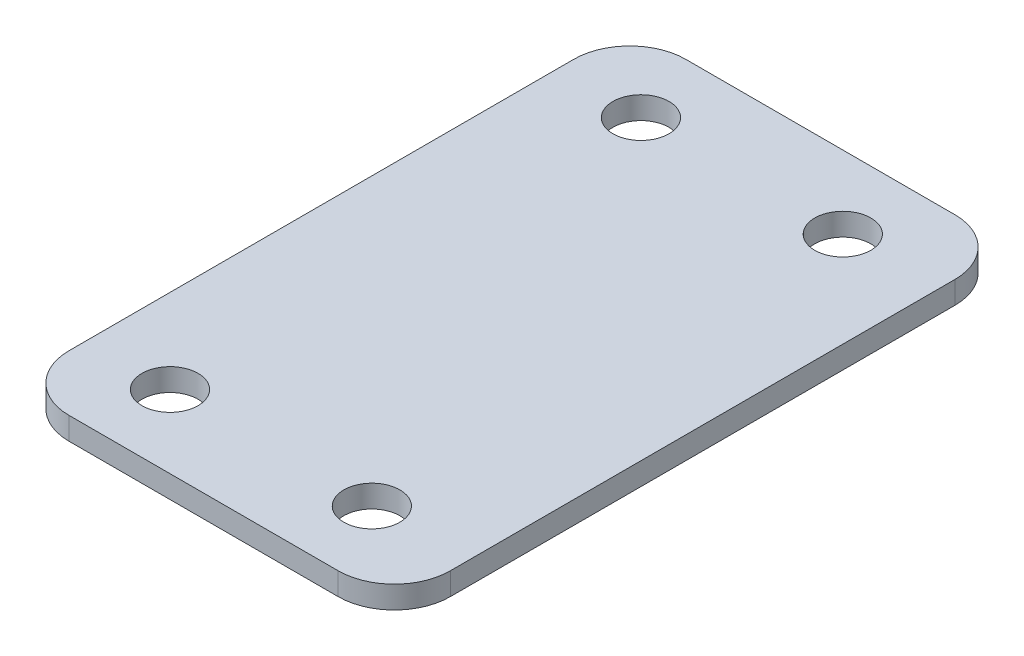
ISO-10303-21;
HEADER;
FILE_DESCRIPTION(('STEP AP214'),'2;1');
FILE_NAME('part.step','',(''),(''),'','','');
FILE_SCHEMA(('AUTOMOTIVE_DESIGN { 1 0 10303 214 1 1 1 1 }'));
ENDSEC;
DATA;
#1=APPLICATION_CONTEXT('core data for automotive mechanical design processes');
#2=APPLICATION_PROTOCOL_DEFINITION('international standard','automotive_design',2000,#1);
#3=PRODUCT_CONTEXT('',#1,'mechanical');
#4=PRODUCT('Part','Part','',(#3));
#5=PRODUCT_RELATED_PRODUCT_CATEGORY('part','',(#4));
#6=PRODUCT_DEFINITION_FORMATION('','',#4);
#7=PRODUCT_DEFINITION_CONTEXT('part definition',#1,'design');
#8=PRODUCT_DEFINITION('design','',#6,#7);
#9=PRODUCT_DEFINITION_SHAPE('','',#8);
#10=(LENGTH_UNIT() NAMED_UNIT(*) SI_UNIT(.MILLI.,.METRE.));
#11=(NAMED_UNIT(*) PLANE_ANGLE_UNIT() SI_UNIT($,.RADIAN.));
#12=(NAMED_UNIT(*) SI_UNIT($,.STERADIAN.) SOLID_ANGLE_UNIT());
#13=UNCERTAINTY_MEASURE_WITH_UNIT(LENGTH_MEASURE(1.E-05),#10,'distance_accuracy_value','');
#14=(GEOMETRIC_REPRESENTATION_CONTEXT(3) GLOBAL_UNCERTAINTY_ASSIGNED_CONTEXT((#13)) GLOBAL_UNIT_ASSIGNED_CONTEXT((#10,
#11,#12)) REPRESENTATION_CONTEXT('',''));
#15=CARTESIAN_POINT('',(0.,0.,0.));
#16=DIRECTION('',(0.,0.,1.));
#17=DIRECTION('',(1.,0.,0.));
#18=AXIS2_PLACEMENT_3D('',#15,#16,#17);
#19=CARTESIAN_POINT('',(-20.,2.,27.5));
#20=DIRECTION('',(1.,0.,0.));
#21=DIRECTION('',(0.,0.,-1.));
#22=AXIS2_PLACEMENT_3D('',#19,#20,#21);
#23=PLANE('',#22);
#24=DIRECTION('',(0.,0.,1.));
#25=VECTOR('',#24,1.);
#26=CARTESIAN_POINT('',(-20.,2.,27.5));
#27=LINE('',#26,#25);
#28=CARTESIAN_POINT('',(-20.,2.,-22.5));
#29=VERTEX_POINT('',#28);
#30=CARTESIAN_POINT('',(-20.,2.,22.5));
#31=VERTEX_POINT('',#30);
#32=EDGE_CURVE('E117',#29,#31,#27,.T.);
#33=ORIENTED_EDGE('',*,*,#32,.F.);
#34=DIRECTION('',(0.,-1.,0.));
#35=VECTOR('',#34,1.);
#36=CARTESIAN_POINT('',(-20.,2.,-22.5));
#37=LINE('',#36,#35);
#38=CARTESIAN_POINT('',(-20.,0.,-22.5));
#39=VERTEX_POINT('',#38);
#40=EDGE_CURVE('E103',#29,#39,#37,.T.);
#41=ORIENTED_EDGE('',*,*,#40,.T.);
#42=DIRECTION('',(0.,0.,1.));
#43=VECTOR('',#42,1.);
#44=CARTESIAN_POINT('',(-20.,0.,27.5));
#45=LINE('',#44,#43);
#46=CARTESIAN_POINT('',(-20.,0.,22.5));
#47=VERTEX_POINT('',#46);
#48=EDGE_CURVE('E115',#39,#47,#45,.T.);
#49=ORIENTED_EDGE('',*,*,#48,.T.);
#50=DIRECTION('',(0.,-1.,0.));
#51=VECTOR('',#50,1.);
#52=CARTESIAN_POINT('',(-20.,2.,22.5));
#53=LINE('',#52,#51);
#54=EDGE_CURVE('E119',#47,#31,#53,.F.);
#55=ORIENTED_EDGE('',*,*,#54,.T.);
#56=EDGE_LOOP('',(#33,#41,#49,#55));
#57=FACE_BOUND('',#56,.T.);
#58=ADVANCED_FACE('F32',(#57),#23,.F.);
#59=CARTESIAN_POINT('',(20.,2.,27.5));
#60=DIRECTION('',(0.,0.,-1.));
#61=DIRECTION('',(-1.,0.,0.));
#62=AXIS2_PLACEMENT_3D('',#59,#60,#61);
#63=PLANE('',#62);
#64=DIRECTION('',(1.,0.,0.));
#65=VECTOR('',#64,1.);
#66=CARTESIAN_POINT('',(20.,0.,27.5));
#67=LINE('',#66,#65);
#68=CARTESIAN_POINT('',(-15.,0.,27.5));
#69=VERTEX_POINT('',#68);
#70=CARTESIAN_POINT('',(9.00000000000001,0.,27.5));
#71=VERTEX_POINT('',#70);
#72=EDGE_CURVE('E123',#69,#71,#67,.T.);
#73=ORIENTED_EDGE('',*,*,#72,.T.);
#74=DIRECTION('',(0.,1.,0.));
#75=VECTOR('',#74,1.);
#76=CARTESIAN_POINT('',(9.00000000000001,2.,27.5));
#77=LINE('',#76,#75);
#78=CARTESIAN_POINT('',(9.00000000000001,2.,27.5));
#79=VERTEX_POINT('',#78);
#80=EDGE_CURVE('E11',#71,#79,#77,.T.);
#81=ORIENTED_EDGE('',*,*,#80,.T.);
#82=DIRECTION('',(1.,0.,0.));
#83=VECTOR('',#82,1.);
#84=CARTESIAN_POINT('',(20.,2.,27.5));
#85=LINE('',#84,#83);
#86=CARTESIAN_POINT('',(-15.,2.,27.5));
#87=VERTEX_POINT('',#86);
#88=EDGE_CURVE('E158',#87,#79,#85,.T.);
#89=ORIENTED_EDGE('',*,*,#88,.F.);
#90=DIRECTION('',(0.,-1.,0.));
#91=VECTOR('',#90,1.);
#92=CARTESIAN_POINT('',(-15.,2.,27.5));
#93=LINE('',#92,#91);
#94=EDGE_CURVE('E40',#87,#69,#93,.T.);
#95=ORIENTED_EDGE('',*,*,#94,.T.);
#96=EDGE_LOOP('',(#73,#81,#89,#95));
#97=FACE_BOUND('',#96,.T.);
#98=ADVANCED_FACE('F157',(#97),#63,.F.);
#99=CARTESIAN_POINT('',(20.,2.,-27.5));
#100=DIRECTION('',(0.,0.,1.));
#101=DIRECTION('',(1.,0.,0.));
#102=AXIS2_PLACEMENT_3D('',#99,#100,#101);
#103=PLANE('',#102);
#104=DIRECTION('',(-1.,0.,0.));
#105=VECTOR('',#104,1.);
#106=CARTESIAN_POINT('',(20.,0.,-27.5));
#107=LINE('',#106,#105);
#108=CARTESIAN_POINT('',(9.00000000000001,0.,-27.5));
#109=VERTEX_POINT('',#108);
#110=CARTESIAN_POINT('',(-15.,0.,-27.5));
#111=VERTEX_POINT('',#110);
#112=EDGE_CURVE('E127',#109,#111,#107,.T.);
#113=ORIENTED_EDGE('',*,*,#112,.T.);
#114=DIRECTION('',(0.,-1.,0.));
#115=VECTOR('',#114,1.);
#116=CARTESIAN_POINT('',(-15.,2.,-27.5));
#117=LINE('',#116,#115);
#118=CARTESIAN_POINT('',(-15.,2.,-27.5));
#119=VERTEX_POINT('',#118);
#120=EDGE_CURVE('E104',#111,#119,#117,.F.);
#121=ORIENTED_EDGE('',*,*,#120,.T.);
#122=DIRECTION('',(-1.,0.,0.));
#123=VECTOR('',#122,1.);
#124=CARTESIAN_POINT('',(20.,2.,-27.5));
#125=LINE('',#124,#123);
#126=CARTESIAN_POINT('',(9.00000000000001,2.,-27.5));
#127=VERTEX_POINT('',#126);
#128=EDGE_CURVE('E133',#127,#119,#125,.T.);
#129=ORIENTED_EDGE('',*,*,#128,.F.);
#130=DIRECTION('',(0.,1.,0.));
#131=VECTOR('',#130,1.);
#132=CARTESIAN_POINT('',(9.00000000000001,2.,-27.5));
#133=LINE('',#132,#131);
#134=EDGE_CURVE('E109',#127,#109,#133,.F.);
#135=ORIENTED_EDGE('',*,*,#134,.T.);
#136=EDGE_LOOP('',(#113,#121,#129,#135));
#137=FACE_BOUND('',#136,.T.);
#138=ADVANCED_FACE('F201',(#137),#103,.F.);
#139=CARTESIAN_POINT('',(0.,2.,0.));
#140=DIRECTION('',(0.,1.,0.));
#141=DIRECTION('',(0.,0.,1.));
#142=AXIS2_PLACEMENT_3D('',#139,#140,#141);
#143=PLANE('',#142);
#144=ORIENTED_EDGE('',*,*,#128,.T.);
#145=CARTESIAN_POINT('',(-15.,2.,-22.5));
#146=DIRECTION('',(0.,1.,0.));
#147=DIRECTION('',(0.,0.,1.));
#148=AXIS2_PLACEMENT_3D('',#145,#146,#147);
#149=CIRCLE('',#148,5.);
#150=EDGE_CURVE('E148',#119,#29,#149,.T.);
#151=ORIENTED_EDGE('',*,*,#150,.T.);
#152=ORIENTED_EDGE('',*,*,#32,.T.);
#153=CARTESIAN_POINT('',(-15.,2.,22.5));
#154=DIRECTION('',(0.,1.,0.));
#155=DIRECTION('',(0.,0.,1.));
#156=AXIS2_PLACEMENT_3D('',#153,#154,#155);
#157=CIRCLE('',#156,5.);
#158=EDGE_CURVE('E54',#31,#87,#157,.T.);
#159=ORIENTED_EDGE('',*,*,#158,.T.);
#160=ORIENTED_EDGE('',*,*,#88,.T.);
#161=CARTESIAN_POINT('',(9.00000000000001,2.,22.5));
#162=DIRECTION('',(0.,1.,0.));
#163=DIRECTION('',(0.,0.,1.));
#164=AXIS2_PLACEMENT_3D('',#161,#162,#163);
#165=CIRCLE('',#164,5.);
#166=CARTESIAN_POINT('',(14.,2.,22.5));
#167=VERTEX_POINT('',#166);
#168=EDGE_CURVE('E47',#79,#167,#165,.T.);
#169=ORIENTED_EDGE('',*,*,#168,.T.);
#170=DIRECTION('',(0.,0.,1.));
#171=VECTOR('',#170,1.);
#172=CARTESIAN_POINT('',(14.,2.,-27.5));
#173=LINE('',#172,#171);
#174=CARTESIAN_POINT('',(14.,2.,-22.5));
#175=VERTEX_POINT('',#174);
#176=EDGE_CURVE('E192',#175,#167,#173,.T.);
#177=ORIENTED_EDGE('',*,*,#176,.F.);
#178=CARTESIAN_POINT('',(9.00000000000001,2.,-22.5));
#179=DIRECTION('',(0.,1.,0.));
#180=DIRECTION('',(0.,0.,1.));
#181=AXIS2_PLACEMENT_3D('',#178,#179,#180);
#182=CIRCLE('',#181,5.);
#183=EDGE_CURVE('E146',#175,#127,#182,.T.);
#184=ORIENTED_EDGE('',*,*,#183,.T.);
#185=EDGE_LOOP('',(#144,#151,#152,#159,#160,#169,#177,#184));
#186=FACE_BOUND('',#185,.T.);
#187=CARTESIAN_POINT('',(-12.5,2.,21.));
#188=DIRECTION('',(0.,1.,0.));
#189=DIRECTION('',(0.,0.,1.));
#190=AXIS2_PLACEMENT_3D('',#187,#188,#189);
#191=CIRCLE('',#190,2.5);
#192=CARTESIAN_POINT('',(-12.5,2.,23.5));
#193=VERTEX_POINT('',#192);
#194=EDGE_CURVE('E182',#193,#193,#191,.T.);
#195=ORIENTED_EDGE('',*,*,#194,.F.);
#196=EDGE_LOOP('',(#195));
#197=FACE_BOUND('',#196,.T.);
#198=CARTESIAN_POINT('',(5.50000000000001,2.,-21.));
#199=DIRECTION('',(0.,1.,0.));
#200=DIRECTION('',(0.,0.,1.));
#201=AXIS2_PLACEMENT_3D('',#198,#199,#200);
#202=CIRCLE('',#201,2.5);
#203=CARTESIAN_POINT('',(5.50000000000001,2.,-18.5));
#204=VERTEX_POINT('',#203);
#205=EDGE_CURVE('E175',#204,#204,#202,.T.);
#206=ORIENTED_EDGE('',*,*,#205,.F.);
#207=EDGE_LOOP('',(#206));
#208=FACE_BOUND('',#207,.T.);
#209=CARTESIAN_POINT('',(5.50000000000001,2.,21.));
#210=DIRECTION('',(0.,1.,0.));
#211=DIRECTION('',(0.,0.,1.));
#212=AXIS2_PLACEMENT_3D('',#209,#210,#211);
#213=CIRCLE('',#212,2.5);
#214=CARTESIAN_POINT('',(5.50000000000001,2.,23.5));
#215=VERTEX_POINT('',#214);
#216=EDGE_CURVE('E187',#215,#215,#213,.T.);
#217=ORIENTED_EDGE('',*,*,#216,.F.);
#218=EDGE_LOOP('',(#217));
#219=FACE_BOUND('',#218,.T.);
#220=CARTESIAN_POINT('',(-12.5,2.,-21.));
#221=DIRECTION('',(0.,1.,0.));
#222=DIRECTION('',(0.,0.,1.));
#223=AXIS2_PLACEMENT_3D('',#220,#221,#222);
#224=CIRCLE('',#223,2.5);
#225=CARTESIAN_POINT('',(-12.5,2.,-18.5));
#226=VERTEX_POINT('',#225);
#227=EDGE_CURVE('E130',#226,#226,#224,.T.);
#228=ORIENTED_EDGE('',*,*,#227,.F.);
#229=EDGE_LOOP('',(#228));
#230=FACE_BOUND('',#229,.T.);
#231=ADVANCED_FACE('F166',(#186,#197,#208,#219,#230),#143,.T.);
#232=CARTESIAN_POINT('',(0.,0.,0.));
#233=DIRECTION('',(0.,1.,0.));
#234=DIRECTION('',(0.,0.,1.));
#235=AXIS2_PLACEMENT_3D('',#232,#233,#234);
#236=PLANE('',#235);
#237=CARTESIAN_POINT('',(-12.5,0.,21.));
#238=DIRECTION('',(0.,1.,0.));
#239=DIRECTION('',(0.,0.,1.));
#240=AXIS2_PLACEMENT_3D('',#237,#238,#239);
#241=CIRCLE('',#240,2.5);
#242=CARTESIAN_POINT('',(-12.5,0.,23.5));
#243=VERTEX_POINT('',#242);
#244=EDGE_CURVE('E173',#243,#243,#241,.T.);
#245=ORIENTED_EDGE('',*,*,#244,.T.);
#246=EDGE_LOOP('',(#245));
#247=FACE_BOUND('',#246,.T.);
#248=CARTESIAN_POINT('',(5.50000000000001,0.,-21.));
#249=DIRECTION('',(0.,1.,0.));
#250=DIRECTION('',(0.,0.,1.));
#251=AXIS2_PLACEMENT_3D('',#248,#249,#250);
#252=CIRCLE('',#251,2.5);
#253=CARTESIAN_POINT('',(5.50000000000001,0.,-18.5));
#254=VERTEX_POINT('',#253);
#255=EDGE_CURVE('E178',#254,#254,#252,.T.);
#256=ORIENTED_EDGE('',*,*,#255,.T.);
#257=EDGE_LOOP('',(#256));
#258=FACE_BOUND('',#257,.T.);
#259=CARTESIAN_POINT('',(5.50000000000001,0.,21.));
#260=DIRECTION('',(0.,1.,0.));
#261=DIRECTION('',(0.,0.,1.));
#262=AXIS2_PLACEMENT_3D('',#259,#260,#261);
#263=CIRCLE('',#262,2.5);
#264=CARTESIAN_POINT('',(5.50000000000001,0.,23.5));
#265=VERTEX_POINT('',#264);
#266=EDGE_CURVE('E179',#265,#265,#263,.T.);
#267=ORIENTED_EDGE('',*,*,#266,.T.);
#268=EDGE_LOOP('',(#267));
#269=FACE_BOUND('',#268,.T.);
#270=CARTESIAN_POINT('',(-12.5,0.,-21.));
#271=DIRECTION('',(0.,1.,0.));
#272=DIRECTION('',(0.,0.,1.));
#273=AXIS2_PLACEMENT_3D('',#270,#271,#272);
#274=CIRCLE('',#273,2.5);
#275=CARTESIAN_POINT('',(-12.5,0.,-18.5));
#276=VERTEX_POINT('',#275);
#277=EDGE_CURVE('E124',#276,#276,#274,.T.);
#278=ORIENTED_EDGE('',*,*,#277,.T.);
#279=EDGE_LOOP('',(#278));
#280=FACE_BOUND('',#279,.T.);
#281=ORIENTED_EDGE('',*,*,#48,.F.);
#282=CARTESIAN_POINT('',(-15.,0.,-22.5));
#283=DIRECTION('',(0.,1.,0.));
#284=DIRECTION('',(0.,0.,1.));
#285=AXIS2_PLACEMENT_3D('',#282,#283,#284);
#286=CIRCLE('',#285,5.);
#287=EDGE_CURVE('E99',#39,#111,#286,.F.);
#288=ORIENTED_EDGE('',*,*,#287,.T.);
#289=ORIENTED_EDGE('',*,*,#112,.F.);
#290=CARTESIAN_POINT('',(9.00000000000001,0.,-22.5));
#291=DIRECTION('',(0.,1.,0.));
#292=DIRECTION('',(0.,0.,1.));
#293=AXIS2_PLACEMENT_3D('',#290,#291,#292);
#294=CIRCLE('',#293,5.);
#295=CARTESIAN_POINT('',(14.,0.,-22.5));
#296=VERTEX_POINT('',#295);
#297=EDGE_CURVE('E110',#109,#296,#294,.F.);
#298=ORIENTED_EDGE('',*,*,#297,.T.);
#299=DIRECTION('',(0.,0.,1.));
#300=VECTOR('',#299,1.);
#301=CARTESIAN_POINT('',(14.,0.,-27.5));
#302=LINE('',#301,#300);
#303=CARTESIAN_POINT('',(14.,0.,22.5));
#304=VERTEX_POINT('',#303);
#305=EDGE_CURVE('E163',#296,#304,#302,.T.);
#306=ORIENTED_EDGE('',*,*,#305,.T.);
#307=CARTESIAN_POINT('',(9.00000000000001,0.,22.5));
#308=DIRECTION('',(0.,1.,0.));
#309=DIRECTION('',(0.,0.,1.));
#310=AXIS2_PLACEMENT_3D('',#307,#308,#309);
#311=CIRCLE('',#310,5.);
#312=EDGE_CURVE('E139',#304,#71,#311,.F.);
#313=ORIENTED_EDGE('',*,*,#312,.T.);
#314=ORIENTED_EDGE('',*,*,#72,.F.);
#315=CARTESIAN_POINT('',(-15.,0.,22.5));
#316=DIRECTION('',(0.,1.,0.));
#317=DIRECTION('',(0.,0.,1.));
#318=AXIS2_PLACEMENT_3D('',#315,#316,#317);
#319=CIRCLE('',#318,5.);
#320=EDGE_CURVE('E118',#69,#47,#319,.F.);
#321=ORIENTED_EDGE('',*,*,#320,.T.);
#322=EDGE_LOOP('',(#281,#288,#289,#298,#306,#313,#314,#321));
#323=FACE_BOUND('',#322,.T.);
#324=ADVANCED_FACE('F121',(#247,#258,#269,#280,#323),#236,.F.);
#325=CARTESIAN_POINT('',(-12.5,0.,-21.));
#326=DIRECTION('',(0.,1.,0.));
#327=DIRECTION('',(0.,0.,1.));
#328=AXIS2_PLACEMENT_3D('',#325,#326,#327);
#329=CYLINDRICAL_SURFACE('',#328,2.5);
#330=ORIENTED_EDGE('',*,*,#277,.F.);
#331=EDGE_LOOP('',(#330));
#332=FACE_BOUND('',#331,.T.);
#333=ORIENTED_EDGE('',*,*,#227,.T.);
#334=EDGE_LOOP('',(#333));
#335=FACE_BOUND('',#334,.T.);
#336=ADVANCED_FACE('F222',(#332,#335),#329,.F.);
#337=CARTESIAN_POINT('',(5.50000000000001,0.,21.));
#338=DIRECTION('',(0.,1.,0.));
#339=DIRECTION('',(0.,0.,1.));
#340=AXIS2_PLACEMENT_3D('',#337,#338,#339);
#341=CYLINDRICAL_SURFACE('',#340,2.5);
#342=ORIENTED_EDGE('',*,*,#266,.F.);
#343=EDGE_LOOP('',(#342));
#344=FACE_BOUND('',#343,.T.);
#345=ORIENTED_EDGE('',*,*,#216,.T.);
#346=EDGE_LOOP('',(#345));
#347=FACE_BOUND('',#346,.T.);
#348=ADVANCED_FACE('F228',(#344,#347),#341,.F.);
#349=CARTESIAN_POINT('',(5.50000000000001,0.,-21.));
#350=DIRECTION('',(0.,1.,0.));
#351=DIRECTION('',(0.,0.,1.));
#352=AXIS2_PLACEMENT_3D('',#349,#350,#351);
#353=CYLINDRICAL_SURFACE('',#352,2.5);
#354=ORIENTED_EDGE('',*,*,#255,.F.);
#355=EDGE_LOOP('',(#354));
#356=FACE_BOUND('',#355,.T.);
#357=ORIENTED_EDGE('',*,*,#205,.T.);
#358=EDGE_LOOP('',(#357));
#359=FACE_BOUND('',#358,.T.);
#360=ADVANCED_FACE('F230',(#356,#359),#353,.F.);
#361=CARTESIAN_POINT('',(-12.5,0.,21.));
#362=DIRECTION('',(0.,1.,0.));
#363=DIRECTION('',(0.,0.,1.));
#364=AXIS2_PLACEMENT_3D('',#361,#362,#363);
#365=CYLINDRICAL_SURFACE('',#364,2.5);
#366=ORIENTED_EDGE('',*,*,#244,.F.);
#367=EDGE_LOOP('',(#366));
#368=FACE_BOUND('',#367,.T.);
#369=ORIENTED_EDGE('',*,*,#194,.T.);
#370=EDGE_LOOP('',(#369));
#371=FACE_BOUND('',#370,.T.);
#372=ADVANCED_FACE('F233',(#368,#371),#365,.F.);
#373=CARTESIAN_POINT('',(14.,0.,-27.5));
#374=DIRECTION('',(-1.,0.,0.));
#375=DIRECTION('',(0.,0.,1.));
#376=AXIS2_PLACEMENT_3D('',#373,#374,#375);
#377=PLANE('',#376);
#378=ORIENTED_EDGE('',*,*,#305,.F.);
#379=DIRECTION('',(0.,1.,0.));
#380=VECTOR('',#379,1.);
#381=CARTESIAN_POINT('',(14.,0.,-22.5));
#382=LINE('',#381,#380);
#383=EDGE_CURVE('E152',#296,#175,#382,.T.);
#384=ORIENTED_EDGE('',*,*,#383,.T.);
#385=ORIENTED_EDGE('',*,*,#176,.T.);
#386=DIRECTION('',(0.,1.,0.));
#387=VECTOR('',#386,1.);
#388=CARTESIAN_POINT('',(14.,0.,22.5));
#389=LINE('',#388,#387);
#390=EDGE_CURVE('E150',#167,#304,#389,.F.);
#391=ORIENTED_EDGE('',*,*,#390,.T.);
#392=EDGE_LOOP('',(#378,#384,#385,#391));
#393=FACE_BOUND('',#392,.T.);
#394=ADVANCED_FACE('F195',(#393),#377,.F.);
#395=CARTESIAN_POINT('',(-15.,2.,-22.5));
#396=DIRECTION('',(0.,-1.,0.));
#397=DIRECTION('',(0.,0.,-1.));
#398=AXIS2_PLACEMENT_3D('',#395,#396,#397);
#399=CYLINDRICAL_SURFACE('',#398,5.);
#400=ORIENTED_EDGE('',*,*,#150,.F.);
#401=ORIENTED_EDGE('',*,*,#120,.F.);
#402=ORIENTED_EDGE('',*,*,#287,.F.);
#403=ORIENTED_EDGE('',*,*,#40,.F.);
#404=EDGE_LOOP('',(#400,#401,#402,#403));
#405=FACE_BOUND('',#404,.T.);
#406=ADVANCED_FACE('F102',(#405),#399,.T.);
#407=CARTESIAN_POINT('',(9.00000000000001,0.,-22.5));
#408=DIRECTION('',(0.,1.,0.));
#409=DIRECTION('',(0.,0.,1.));
#410=AXIS2_PLACEMENT_3D('',#407,#408,#409);
#411=CYLINDRICAL_SURFACE('',#410,5.);
#412=ORIENTED_EDGE('',*,*,#297,.F.);
#413=ORIENTED_EDGE('',*,*,#134,.F.);
#414=ORIENTED_EDGE('',*,*,#183,.F.);
#415=ORIENTED_EDGE('',*,*,#383,.F.);
#416=EDGE_LOOP('',(#412,#413,#414,#415));
#417=FACE_BOUND('',#416,.T.);
#418=ADVANCED_FACE('F203',(#417),#411,.T.);
#419=CARTESIAN_POINT('',(9.00000000000001,2.,22.5));
#420=DIRECTION('',(0.,1.,0.));
#421=DIRECTION('',(0.,0.,1.));
#422=AXIS2_PLACEMENT_3D('',#419,#420,#421);
#423=CYLINDRICAL_SURFACE('',#422,5.);
#424=ORIENTED_EDGE('',*,*,#312,.F.);
#425=ORIENTED_EDGE('',*,*,#390,.F.);
#426=ORIENTED_EDGE('',*,*,#168,.F.);
#427=ORIENTED_EDGE('',*,*,#80,.F.);
#428=EDGE_LOOP('',(#424,#425,#426,#427));
#429=FACE_BOUND('',#428,.T.);
#430=ADVANCED_FACE('F164',(#429),#423,.T.);
#431=CARTESIAN_POINT('',(-15.,2.,22.5));
#432=DIRECTION('',(0.,-1.,0.));
#433=DIRECTION('',(0.,0.,-1.));
#434=AXIS2_PLACEMENT_3D('',#431,#432,#433);
#435=CYLINDRICAL_SURFACE('',#434,5.);
#436=ORIENTED_EDGE('',*,*,#158,.F.);
#437=ORIENTED_EDGE('',*,*,#54,.F.);
#438=ORIENTED_EDGE('',*,*,#320,.F.);
#439=ORIENTED_EDGE('',*,*,#94,.F.);
#440=EDGE_LOOP('',(#436,#437,#438,#439));
#441=FACE_BOUND('',#440,.T.);
#442=ADVANCED_FACE('F34',(#441),#435,.T.);
#443=CLOSED_SHELL('',(#58,#98,#138,#231,#324,#336,#348,#360,#372,#394,#406,#418,#430,#442));
#444=MANIFOLD_SOLID_BREP('B2',#443);
#445=ADVANCED_BREP_SHAPE_REPRESENTATION('',(#18,#444),#14);
#446=SHAPE_DEFINITION_REPRESENTATION(#9,#445);
ENDSEC;
END-ISO-10303-21;
